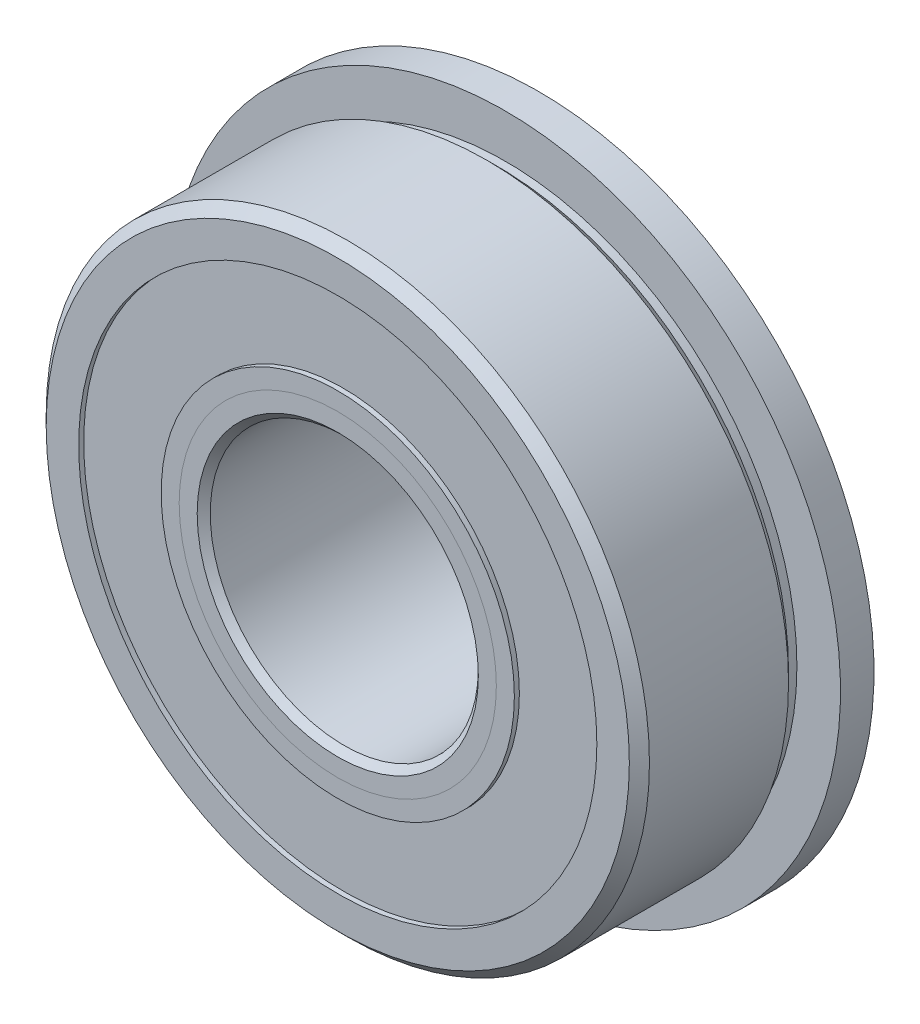
ISO-10303-21;
HEADER;
FILE_DESCRIPTION(('STEP AP214'),'2;1');
FILE_NAME('part.step','',(''),(''),'','','');
FILE_SCHEMA(('AUTOMOTIVE_DESIGN { 1 0 10303 214 1 1 1 1 }'));
ENDSEC;
DATA;
#1=APPLICATION_CONTEXT('core data for automotive mechanical design processes');
#2=APPLICATION_PROTOCOL_DEFINITION('international standard','automotive_design',2000,#1);
#3=PRODUCT_CONTEXT('',#1,'mechanical');
#4=PRODUCT('Part','Part','',(#3));
#5=PRODUCT_RELATED_PRODUCT_CATEGORY('part','',(#4));
#6=PRODUCT_DEFINITION_FORMATION('','',#4);
#7=PRODUCT_DEFINITION_CONTEXT('part definition',#1,'design');
#8=PRODUCT_DEFINITION('design','',#6,#7);
#9=PRODUCT_DEFINITION_SHAPE('','',#8);
#10=(LENGTH_UNIT() NAMED_UNIT(*) SI_UNIT(.MILLI.,.METRE.));
#11=(NAMED_UNIT(*) PLANE_ANGLE_UNIT() SI_UNIT($,.RADIAN.));
#12=(NAMED_UNIT(*) SI_UNIT($,.STERADIAN.) SOLID_ANGLE_UNIT());
#13=UNCERTAINTY_MEASURE_WITH_UNIT(LENGTH_MEASURE(1.E-05),#10,'distance_accuracy_value','');
#14=(GEOMETRIC_REPRESENTATION_CONTEXT(3) GLOBAL_UNCERTAINTY_ASSIGNED_CONTEXT((#13)) GLOBAL_UNIT_ASSIGNED_CONTEXT((#10,
#11,#12)) REPRESENTATION_CONTEXT('',''));
#15=CARTESIAN_POINT('',(0.,0.,0.));
#16=DIRECTION('',(0.,0.,1.));
#17=DIRECTION('',(1.,0.,0.));
#18=AXIS2_PLACEMENT_3D('',#15,#16,#17);
#19=CARTESIAN_POINT('',(0.,0.,4.7625));
#20=DIRECTION('',(0.,0.,1.));
#21=DIRECTION('',(1.,0.,0.));
#22=AXIS2_PLACEMENT_3D('',#19,#20,#21);
#23=CYLINDRICAL_SURFACE('',#22,8.7376);
#24=CARTESIAN_POINT('',(0.,0.,-3.35017734788581));
#25=DIRECTION('',(0.,0.,1.));
#26=DIRECTION('',(1.,0.,0.));
#27=AXIS2_PLACEMENT_3D('',#24,#25,#26);
#28=CIRCLE('',#27,8.7376);
#29=CARTESIAN_POINT('',(8.7376,0.,-3.35017734788581));
#30=VERTEX_POINT('',#29);
#31=EDGE_CURVE('E11',#30,#30,#28,.T.);
#32=ORIENTED_EDGE('',*,*,#31,.T.);
#33=EDGE_LOOP('',(#32));
#34=FACE_BOUND('',#33,.T.);
#35=CARTESIAN_POINT('',(0.,0.,-4.270375));
#36=DIRECTION('',(0.,0.,-1.));
#37=DIRECTION('',(-1.,0.,0.));
#38=AXIS2_PLACEMENT_3D('',#35,#36,#37);
#39=CIRCLE('',#38,8.7376);
#40=CARTESIAN_POINT('',(-8.7376,0.,-4.270375));
#41=VERTEX_POINT('',#40);
#42=EDGE_CURVE('E71',#41,#41,#39,.T.);
#43=ORIENTED_EDGE('',*,*,#42,.T.);
#44=EDGE_LOOP('',(#43));
#45=FACE_BOUND('',#44,.T.);
#46=ADVANCED_FACE('F50',(#34,#45),#23,.F.);
#47=CARTESIAN_POINT('',(0.,12.2725961538462,-4.524375));
#48=DIRECTION('',(0.,0.,1.));
#49=DIRECTION('',(1.,0.,0.));
#50=AXIS2_PLACEMENT_3D('',#47,#48,#49);
#51=PLANE('',#50);
#52=CARTESIAN_POINT('',(0.,0.,-4.524375));
#53=DIRECTION('',(0.,0.,-1.));
#54=DIRECTION('',(-1.,0.,0.));
#55=AXIS2_PLACEMENT_3D('',#52,#53,#54);
#56=CIRCLE('',#55,9.436608);
#57=CARTESIAN_POINT('',(-9.436608,0.,-4.524375));
#58=VERTEX_POINT('',#57);
#59=EDGE_CURVE('E68',#58,#58,#56,.T.);
#60=ORIENTED_EDGE('',*,*,#59,.F.);
#61=EDGE_LOOP('',(#60));
#62=FACE_BOUND('',#61,.T.);
#63=CARTESIAN_POINT('',(0.,0.,-4.524375));
#64=DIRECTION('',(0.,0.,1.));
#65=DIRECTION('',(1.,0.,0.));
#66=AXIS2_PLACEMENT_3D('',#63,#64,#65);
#67=CIRCLE('',#66,12.2725961538462);
#68=CARTESIAN_POINT('',(12.2725961538462,0.,-4.524375));
#69=VERTEX_POINT('',#68);
#70=EDGE_CURVE('E61',#69,#69,#67,.T.);
#71=ORIENTED_EDGE('',*,*,#70,.F.);
#72=EDGE_LOOP('',(#71));
#73=FACE_BOUND('',#72,.T.);
#74=ADVANCED_FACE('F52',(#62,#73),#51,.F.);
#75=CARTESIAN_POINT('',(0.,12.2725961538462,-3.35017734788581));
#76=DIRECTION('',(0.,0.,-1.));
#77=DIRECTION('',(-1.,0.,0.));
#78=AXIS2_PLACEMENT_3D('',#75,#76,#77);
#79=PLANE('',#78);
#80=ORIENTED_EDGE('',*,*,#31,.F.);
#81=EDGE_LOOP('',(#80));
#82=FACE_BOUND('',#81,.T.);
#83=CARTESIAN_POINT('',(0.,0.,-3.35017734788581));
#84=DIRECTION('',(0.,0.,1.));
#85=DIRECTION('',(1.,0.,0.));
#86=AXIS2_PLACEMENT_3D('',#83,#84,#85);
#87=CIRCLE('',#86,12.2725961538462);
#88=CARTESIAN_POINT('',(12.2725961538462,0.,-3.35017734788581));
#89=VERTEX_POINT('',#88);
#90=EDGE_CURVE('E57',#89,#89,#87,.T.);
#91=ORIENTED_EDGE('',*,*,#90,.T.);
#92=EDGE_LOOP('',(#91));
#93=FACE_BOUND('',#92,.T.);
#94=ADVANCED_FACE('F93',(#82,#93),#79,.F.);
#95=CARTESIAN_POINT('',(0.,0.,4.7625));
#96=DIRECTION('',(0.,0.,1.));
#97=DIRECTION('',(1.,0.,0.));
#98=AXIS2_PLACEMENT_3D('',#95,#96,#97);
#99=CYLINDRICAL_SURFACE('',#98,12.2725961538462);
#100=ORIENTED_EDGE('',*,*,#90,.F.);
#101=EDGE_LOOP('',(#100));
#102=FACE_BOUND('',#101,.T.);
#103=ORIENTED_EDGE('',*,*,#70,.T.);
#104=EDGE_LOOP('',(#103));
#105=FACE_BOUND('',#104,.T.);
#106=ADVANCED_FACE('F87',(#102,#105),#99,.T.);
#107=CARTESIAN_POINT('',(0.,0.,-4.270375));
#108=DIRECTION('',(0.,0.,-1.));
#109=DIRECTION('',(-1.,0.,0.));
#110=AXIS2_PLACEMENT_3D('',#107,#108,#109);
#111=CYLINDRICAL_SURFACE('',#110,9.436608);
#112=CARTESIAN_POINT('',(0.,0.,-4.270375));
#113=DIRECTION('',(0.,0.,-1.));
#114=DIRECTION('',(-1.,0.,0.));
#115=AXIS2_PLACEMENT_3D('',#112,#113,#114);
#116=CIRCLE('',#115,9.436608);
#117=CARTESIAN_POINT('',(-9.436608,0.,-4.270375));
#118=VERTEX_POINT('',#117);
#119=EDGE_CURVE('E65',#118,#118,#116,.T.);
#120=ORIENTED_EDGE('',*,*,#119,.F.);
#121=EDGE_LOOP('',(#120));
#122=FACE_BOUND('',#121,.T.);
#123=ORIENTED_EDGE('',*,*,#59,.T.);
#124=EDGE_LOOP('',(#123));
#125=FACE_BOUND('',#124,.T.);
#126=ADVANCED_FACE('F81',(#122,#125),#111,.F.);
#127=CARTESIAN_POINT('',(0.,0.,-4.270375));
#128=DIRECTION('',(0.,0.,-1.));
#129=DIRECTION('',(-1.,0.,0.));
#130=AXIS2_PLACEMENT_3D('',#127,#128,#129);
#131=PLANE('',#130);
#132=ORIENTED_EDGE('',*,*,#42,.F.);
#133=EDGE_LOOP('',(#132));
#134=FACE_BOUND('',#133,.T.);
#135=ORIENTED_EDGE('',*,*,#119,.T.);
#136=EDGE_LOOP('',(#135));
#137=FACE_BOUND('',#136,.T.);
#138=ADVANCED_FACE('F78',(#134,#137),#131,.T.);
#139=CLOSED_SHELL('',(#46,#74,#94,#106,#126,#138));
#140=MANIFOLD_SOLID_BREP('B2',#139);
#141=CARTESIAN_POINT('',(0.,12.2725961538462,4.524375));
#142=DIRECTION('',(0.,0.,-1.));
#143=DIRECTION('',(-1.,0.,0.));
#144=AXIS2_PLACEMENT_3D('',#141,#142,#143);
#145=PLANE('',#144);
#146=CARTESIAN_POINT('',(0.,0.,4.524375));
#147=DIRECTION('',(0.,0.,1.));
#148=DIRECTION('',(1.,0.,0.));
#149=AXIS2_PLACEMENT_3D('',#146,#147,#148);
#150=CIRCLE('',#149,8.36490384615385);
#151=CARTESIAN_POINT('',(8.36490384615385,0.,4.524375));
#152=VERTEX_POINT('',#151);
#153=EDGE_CURVE('E49',#152,#152,#150,.T.);
#154=ORIENTED_EDGE('',*,*,#153,.F.);
#155=EDGE_LOOP('',(#154));
#156=FACE_BOUND('',#155,.T.);
#157=CARTESIAN_POINT('',(0.,0.,4.524375));
#158=DIRECTION('',(0.,0.,1.));
#159=DIRECTION('',(1.,0.,0.));
#160=AXIS2_PLACEMENT_3D('',#157,#158,#159);
#161=CIRCLE('',#160,12.2725961538462);
#162=CARTESIAN_POINT('',(12.2725961538462,0.,4.524375));
#163=VERTEX_POINT('',#162);
#164=EDGE_CURVE('E170',#163,#163,#161,.T.);
#165=ORIENTED_EDGE('',*,*,#164,.T.);
#166=EDGE_LOOP('',(#165));
#167=FACE_BOUND('',#166,.T.);
#168=ADVANCED_FACE('F156',(#156,#167),#145,.F.);
#169=CARTESIAN_POINT('',(0.,0.,4.7625));
#170=DIRECTION('',(0.,0.,1.));
#171=DIRECTION('',(1.,0.,0.));
#172=AXIS2_PLACEMENT_3D('',#169,#170,#171);
#173=CYLINDRICAL_SURFACE('',#172,8.36490384615385);
#174=CARTESIAN_POINT('',(0.,0.,3.3501773478858));
#175=DIRECTION('',(0.,0.,1.));
#176=DIRECTION('',(1.,0.,0.));
#177=AXIS2_PLACEMENT_3D('',#174,#175,#176);
#178=CIRCLE('',#177,8.36490384615385);
#179=CARTESIAN_POINT('',(8.36490384615385,0.,3.3501773478858));
#180=VERTEX_POINT('',#179);
#181=EDGE_CURVE('E162',#180,#180,#178,.T.);
#182=ORIENTED_EDGE('',*,*,#181,.F.);
#183=EDGE_LOOP('',(#182));
#184=FACE_BOUND('',#183,.T.);
#185=ORIENTED_EDGE('',*,*,#153,.T.);
#186=EDGE_LOOP('',(#185));
#187=FACE_BOUND('',#186,.T.);
#188=ADVANCED_FACE('F185',(#184,#187),#173,.F.);
#189=CARTESIAN_POINT('',(0.,12.2725961538462,3.3501773478858));
#190=DIRECTION('',(0.,0.,1.));
#191=DIRECTION('',(1.,0.,0.));
#192=AXIS2_PLACEMENT_3D('',#189,#190,#191);
#193=PLANE('',#192);
#194=CARTESIAN_POINT('',(0.,0.,3.35017734788581));
#195=DIRECTION('',(0.,0.,1.));
#196=DIRECTION('',(1.,0.,0.));
#197=AXIS2_PLACEMENT_3D('',#194,#195,#196);
#198=CIRCLE('',#197,12.2725961538462);
#199=CARTESIAN_POINT('',(12.2725961538462,0.,3.35017734788581));
#200=VERTEX_POINT('',#199);
#201=EDGE_CURVE('E166',#200,#200,#198,.T.);
#202=ORIENTED_EDGE('',*,*,#201,.F.);
#203=EDGE_LOOP('',(#202));
#204=FACE_BOUND('',#203,.T.);
#205=ORIENTED_EDGE('',*,*,#181,.T.);
#206=EDGE_LOOP('',(#205));
#207=FACE_BOUND('',#206,.T.);
#208=ADVANCED_FACE('F180',(#204,#207),#193,.F.);
#209=CARTESIAN_POINT('',(0.,0.,4.7625));
#210=DIRECTION('',(0.,0.,1.));
#211=DIRECTION('',(1.,0.,0.));
#212=AXIS2_PLACEMENT_3D('',#209,#210,#211);
#213=CYLINDRICAL_SURFACE('',#212,12.2725961538462);
#214=ORIENTED_EDGE('',*,*,#164,.F.);
#215=EDGE_LOOP('',(#214));
#216=FACE_BOUND('',#215,.T.);
#217=ORIENTED_EDGE('',*,*,#201,.T.);
#218=EDGE_LOOP('',(#217));
#219=FACE_BOUND('',#218,.T.);
#220=ADVANCED_FACE('F177',(#216,#219),#213,.T.);
#221=CLOSED_SHELL('',(#168,#188,#208,#220));
#222=MANIFOLD_SOLID_BREP('B6',#221);
#223=CARTESIAN_POINT('',(-5.15937499999989,8.93629963530074,0.));
#224=DIRECTION('',(0.,0.,1.));
#225=DIRECTION('',(-0.499999999999989,0.866025403784445,0.));
#226=AXIS2_PLACEMENT_3D('',#223,#224,#225);
#227=SPHERICAL_SURFACE('',#226,3.3501773478858);
#228=CARTESIAN_POINT('',(-5.15937499999989,8.93629963530074,3.3501773478858));
#229=VERTEX_POINT('',#228);
#230=VERTEX_LOOP('',#229);
#231=FACE_BOUND('',#230,.T.);
#232=ADVANCED_FACE('F216',(#231),#227,.T.);
#233=CLOSED_SHELL('',(#232));
#234=MANIFOLD_SOLID_BREP('B44',#233);
#235=CARTESIAN_POINT('',(-8.93629963530062,5.1593750000001,0.));
#236=DIRECTION('',(0.,0.,1.));
#237=DIRECTION('',(-0.866025403784433,0.50000000000001,0.));
#238=AXIS2_PLACEMENT_3D('',#235,#236,#237);
#239=SPHERICAL_SURFACE('',#238,3.3501773478858);
#240=CARTESIAN_POINT('',(-8.93629963530062,5.1593750000001,3.3501773478858));
#241=VERTEX_POINT('',#240);
#242=VERTEX_LOOP('',#241);
#243=FACE_BOUND('',#242,.T.);
#244=ADVANCED_FACE('F235',(#243),#239,.T.);
#245=CLOSED_SHELL('',(#244));
#246=MANIFOLD_SOLID_BREP('B152',#245);
#247=CARTESIAN_POINT('',(-10.31875,1.08083169195563E-13,0.));
#248=DIRECTION('',(0.,0.,1.));
#249=DIRECTION('',(-1.,0.,0.));
#250=AXIS2_PLACEMENT_3D('',#247,#248,#249);
#251=SPHERICAL_SURFACE('',#250,3.3501773478858);
#252=CARTESIAN_POINT('',(-10.31875,1.08083169195563E-13,3.3501773478858));
#253=VERTEX_POINT('',#252);
#254=VERTEX_LOOP('',#253);
#255=FACE_BOUND('',#254,.T.);
#256=ADVANCED_FACE('F254',(#255),#251,.T.);
#257=CLOSED_SHELL('',(#256));
#258=MANIFOLD_SOLID_BREP('B212',#257);
#259=CARTESIAN_POINT('',(-8.93629963530072,-5.15937499999992,0.));
#260=DIRECTION('',(0.,0.,1.));
#261=DIRECTION('',(-0.866025403784443,-0.499999999999992,0.));
#262=AXIS2_PLACEMENT_3D('',#259,#260,#261);
#263=SPHERICAL_SURFACE('',#262,3.3501773478858);
#264=CARTESIAN_POINT('',(-8.93629963530072,-5.15937499999992,3.3501773478858));
#265=VERTEX_POINT('',#264);
#266=VERTEX_LOOP('',#265);
#267=FACE_BOUND('',#266,.T.);
#268=ADVANCED_FACE('F273',(#267),#263,.T.);
#269=CLOSED_SHELL('',(#268));
#270=MANIFOLD_SOLID_BREP('B231',#269);
#271=CARTESIAN_POINT('',(-5.15937500000007,-8.93629963530064,0.));
#272=DIRECTION('',(0.,0.,1.));
#273=DIRECTION('',(-0.500000000000007,-0.866025403784435,0.));
#274=AXIS2_PLACEMENT_3D('',#271,#272,#273);
#275=SPHERICAL_SURFACE('',#274,3.3501773478858);
#276=CARTESIAN_POINT('',(-5.15937500000007,-8.93629963530064,3.3501773478858));
#277=VERTEX_POINT('',#276);
#278=VERTEX_LOOP('',#277);
#279=FACE_BOUND('',#278,.T.);
#280=ADVANCED_FACE('F292',(#279),#275,.T.);
#281=CLOSED_SHELL('',(#280));
#282=MANIFOLD_SOLID_BREP('B250',#281);
#283=CARTESIAN_POINT('',(0.,-10.31875,0.));
#284=DIRECTION('',(0.,0.,1.));
#285=DIRECTION('',(0.,-1.,0.));
#286=AXIS2_PLACEMENT_3D('',#283,#284,#285);
#287=SPHERICAL_SURFACE('',#286,3.3501773478858);
#288=CARTESIAN_POINT('',(0.,-10.31875,3.3501773478858));
#289=VERTEX_POINT('',#288);
#290=VERTEX_LOOP('',#289);
#291=FACE_BOUND('',#290,.T.);
#292=ADVANCED_FACE('F311',(#291),#287,.T.);
#293=CLOSED_SHELL('',(#292));
#294=MANIFOLD_SOLID_BREP('B269',#293);
#295=CARTESIAN_POINT('',(5.15937499999995,-8.93629963530071,0.));
#296=DIRECTION('',(0.,0.,1.));
#297=DIRECTION('',(0.499999999999995,-0.866025403784442,0.));
#298=AXIS2_PLACEMENT_3D('',#295,#296,#297);
#299=SPHERICAL_SURFACE('',#298,3.3501773478858);
#300=CARTESIAN_POINT('',(5.15937499999995,-8.93629963530071,3.3501773478858));
#301=VERTEX_POINT('',#300);
#302=VERTEX_LOOP('',#301);
#303=FACE_BOUND('',#302,.T.);
#304=ADVANCED_FACE('F330',(#303),#299,.T.);
#305=CLOSED_SHELL('',(#304));
#306=MANIFOLD_SOLID_BREP('B288',#305);
#307=CARTESIAN_POINT('',(8.93629963530065,-5.15937500000004,0.));
#308=DIRECTION('',(0.,0.,1.));
#309=DIRECTION('',(0.866025403784436,-0.500000000000004,0.));
#310=AXIS2_PLACEMENT_3D('',#307,#308,#309);
#311=SPHERICAL_SURFACE('',#310,3.3501773478858);
#312=CARTESIAN_POINT('',(8.93629963530065,-5.15937500000004,3.3501773478858));
#313=VERTEX_POINT('',#312);
#314=VERTEX_LOOP('',#313);
#315=FACE_BOUND('',#314,.T.);
#316=ADVANCED_FACE('F349',(#315),#311,.T.);
#317=CLOSED_SHELL('',(#316));
#318=MANIFOLD_SOLID_BREP('B307',#317);
#319=CARTESIAN_POINT('',(10.31875,0.,0.));
#320=DIRECTION('',(0.,0.,1.));
#321=DIRECTION('',(1.,0.,0.));
#322=AXIS2_PLACEMENT_3D('',#319,#320,#321);
#323=SPHERICAL_SURFACE('',#322,3.3501773478858);
#324=CARTESIAN_POINT('',(10.31875,0.,3.3501773478858));
#325=VERTEX_POINT('',#324);
#326=VERTEX_LOOP('',#325);
#327=FACE_BOUND('',#326,.T.);
#328=ADVANCED_FACE('F368',(#327),#323,.T.);
#329=CLOSED_SHELL('',(#328));
#330=MANIFOLD_SOLID_BREP('B326',#329);
#331=CARTESIAN_POINT('',(8.93629963530069,5.15937499999998,0.));
#332=DIRECTION('',(0.,0.,1.));
#333=DIRECTION('',(0.86602540378444,0.499999999999998,0.));
#334=AXIS2_PLACEMENT_3D('',#331,#332,#333);
#335=SPHERICAL_SURFACE('',#334,3.3501773478858);
#336=CARTESIAN_POINT('',(8.93629963530069,5.15937499999998,3.3501773478858));
#337=VERTEX_POINT('',#336);
#338=VERTEX_LOOP('',#337);
#339=FACE_BOUND('',#338,.T.);
#340=ADVANCED_FACE('F387',(#339),#335,.T.);
#341=CLOSED_SHELL('',(#340));
#342=MANIFOLD_SOLID_BREP('B345',#341);
#343=CARTESIAN_POINT('',(5.15937500000001,8.93629963530067,0.));
#344=DIRECTION('',(0.,0.,1.));
#345=DIRECTION('',(0.500000000000001,0.866025403784438,0.));
#346=AXIS2_PLACEMENT_3D('',#343,#344,#345);
#347=SPHERICAL_SURFACE('',#346,3.3501773478858);
#348=CARTESIAN_POINT('',(5.15937500000001,8.93629963530067,3.3501773478858));
#349=VERTEX_POINT('',#348);
#350=VERTEX_LOOP('',#349);
#351=FACE_BOUND('',#350,.T.);
#352=ADVANCED_FACE('F406',(#351),#347,.T.);
#353=CLOSED_SHELL('',(#352));
#354=MANIFOLD_SOLID_BREP('B364',#353);
#355=CARTESIAN_POINT('',(0.,10.31875,0.));
#356=DIRECTION('',(0.,0.,1.));
#357=DIRECTION('',(0.,1.,0.));
#358=AXIS2_PLACEMENT_3D('',#355,#356,#357);
#359=SPHERICAL_SURFACE('',#358,3.3501773478858);
#360=CARTESIAN_POINT('',(0.,10.31875,3.3501773478858));
#361=VERTEX_POINT('',#360);
#362=VERTEX_LOOP('',#361);
#363=FACE_BOUND('',#362,.T.);
#364=ADVANCED_FACE('F427',(#363),#359,.T.);
#365=CLOSED_SHELL('',(#364));
#366=MANIFOLD_SOLID_BREP('B383',#365);
#367=CARTESIAN_POINT('',(0.,6.82625,-6.35));
#368=DIRECTION('',(0.,0.,1.));
#369=DIRECTION('',(1.,0.,0.));
#370=AXIS2_PLACEMENT_3D('',#367,#368,#369);
#371=PLANE('',#370);
#372=CARTESIAN_POINT('',(0.,0.,-6.35));
#373=DIRECTION('',(0.,0.,1.));
#374=DIRECTION('',(1.,0.,0.));
#375=AXIS2_PLACEMENT_3D('',#372,#373,#374);
#376=CIRCLE('',#375,6.82625);
#377=CARTESIAN_POINT('',(6.82625,0.,-6.35));
#378=VERTEX_POINT('',#377);
#379=EDGE_CURVE('E472',#378,#378,#376,.T.);
#380=ORIENTED_EDGE('',*,*,#379,.T.);
#381=EDGE_LOOP('',(#380));
#382=FACE_BOUND('',#381,.T.);
#383=CARTESIAN_POINT('',(0.,0.,-6.35));
#384=DIRECTION('',(0.,0.,-1.));
#385=DIRECTION('',(-1.,0.,0.));
#386=AXIS2_PLACEMENT_3D('',#383,#384,#385);
#387=CIRCLE('',#386,7.607173);
#388=CARTESIAN_POINT('',(-7.607173,0.,-6.35));
#389=VERTEX_POINT('',#388);
#390=EDGE_CURVE('E491',#389,#389,#387,.T.);
#391=ORIENTED_EDGE('',*,*,#390,.T.);
#392=EDGE_LOOP('',(#391));
#393=FACE_BOUND('',#392,.T.);
#394=ADVANCED_FACE('F446',(#382,#393),#371,.F.);
#395=CARTESIAN_POINT('',(0.,7.51209508610547,4.7625));
#396=DIRECTION('',(0.,0.,-1.));
#397=DIRECTION('',(-1.,0.,0.));
#398=AXIS2_PLACEMENT_3D('',#395,#396,#397);
#399=PLANE('',#398);
#400=CARTESIAN_POINT('',(0.,0.,4.7625));
#401=DIRECTION('',(0.,0.,1.));
#402=DIRECTION('',(1.,0.,0.));
#403=AXIS2_PLACEMENT_3D('',#400,#401,#402);
#404=CIRCLE('',#403,6.6592863260571);
#405=CARTESIAN_POINT('',(6.6592863260571,0.,4.7625));
#406=VERTEX_POINT('',#405);
#407=EDGE_CURVE('E481',#406,#406,#404,.T.);
#408=ORIENTED_EDGE('',*,*,#407,.F.);
#409=EDGE_LOOP('',(#408));
#410=FACE_BOUND('',#409,.T.);
#411=CARTESIAN_POINT('',(0.,0.,4.7625));
#412=DIRECTION('',(0.,0.,1.));
#413=DIRECTION('',(1.,0.,0.));
#414=AXIS2_PLACEMENT_3D('',#411,#412,#413);
#415=CIRCLE('',#414,7.51209508610547);
#416=CARTESIAN_POINT('',(7.51209508610547,0.,4.7625));
#417=VERTEX_POINT('',#416);
#418=EDGE_CURVE('E426',#417,#417,#415,.T.);
#419=ORIENTED_EDGE('',*,*,#418,.T.);
#420=EDGE_LOOP('',(#419));
#421=FACE_BOUND('',#420,.T.);
#422=ADVANCED_FACE('F448',(#410,#421),#399,.F.);
#423=CARTESIAN_POINT('',(0.,0.,3.90969123995163));
#424=DIRECTION('',(0.,0.,1.));
#425=DIRECTION('',(1.,0.,0.));
#426=AXIS2_PLACEMENT_3D('',#423,#424,#425);
#427=CONICAL_SURFACE('',#426,6.6592863260571,0.785398163397449);
#428=ORIENTED_EDGE('',*,*,#418,.F.);
#429=EDGE_LOOP('',(#428));
#430=FACE_BOUND('',#429,.T.);
#431=CARTESIAN_POINT('',(0.,0.,3.90969123995163));
#432=DIRECTION('',(0.,0.,1.));
#433=DIRECTION('',(1.,0.,0.));
#434=AXIS2_PLACEMENT_3D('',#431,#432,#433);
#435=CIRCLE('',#434,6.6592863260571);
#436=CARTESIAN_POINT('',(6.6592863260571,0.,3.90969123995163));
#437=VERTEX_POINT('',#436);
#438=EDGE_CURVE('E453',#437,#437,#435,.T.);
#439=ORIENTED_EDGE('',*,*,#438,.T.);
#440=EDGE_LOOP('',(#439));
#441=FACE_BOUND('',#440,.T.);
#442=ADVANCED_FACE('F539',(#430,#441),#427,.T.);
#443=CARTESIAN_POINT('',(0.,0.,4.7625));
#444=DIRECTION('',(0.,0.,1.));
#445=DIRECTION('',(1.,0.,0.));
#446=AXIS2_PLACEMENT_3D('',#443,#444,#445);
#447=CYLINDRICAL_SURFACE('',#446,6.6592863260571);
#448=ORIENTED_EDGE('',*,*,#438,.F.);
#449=EDGE_LOOP('',(#448));
#450=FACE_BOUND('',#449,.T.);
#451=CARTESIAN_POINT('',(0.,0.,0.));
#452=DIRECTION('',(0.,0.,1.));
#453=DIRECTION('',(1.,0.,0.));
#454=AXIS2_PLACEMENT_3D('',#451,#452,#453);
#455=CIRCLE('',#454,6.6592863260571);
#456=CARTESIAN_POINT('',(6.6592863260571,0.,0.));
#457=VERTEX_POINT('',#456);
#458=EDGE_CURVE('E457',#457,#457,#455,.T.);
#459=ORIENTED_EDGE('',*,*,#458,.T.);
#460=EDGE_LOOP('',(#459));
#461=FACE_BOUND('',#460,.T.);
#462=ADVANCED_FACE('F593',(#450,#461),#447,.T.);
#463=CARTESIAN_POINT('',(0.,6.6592863260571,0.));
#464=DIRECTION('',(0.,0.,-1.));
#465=DIRECTION('',(-1.,0.,0.));
#466=AXIS2_PLACEMENT_3D('',#463,#464,#465);
#467=PLANE('',#466);
#468=ORIENTED_EDGE('',*,*,#458,.F.);
#469=EDGE_LOOP('',(#468));
#470=FACE_BOUND('',#469,.T.);
#471=CARTESIAN_POINT('',(0.,0.,0.));
#472=DIRECTION('',(0.,0.,1.));
#473=DIRECTION('',(1.,0.,0.));
#474=AXIS2_PLACEMENT_3D('',#471,#472,#473);
#475=CIRCLE('',#474,6.9685726521142);
#476=CARTESIAN_POINT('',(6.9685726521142,0.,0.));
#477=VERTEX_POINT('',#476);
#478=EDGE_CURVE('E461',#477,#477,#475,.T.);
#479=ORIENTED_EDGE('',*,*,#478,.T.);
#480=EDGE_LOOP('',(#479));
#481=FACE_BOUND('',#480,.T.);
#482=ADVANCED_FACE('F529',(#470,#481),#467,.F.);
#483=CARTESIAN_POINT('',(0.,0.,0.));
#484=DIRECTION('',(0.,0.,1.));
#485=DIRECTION('',(1.,0.,0.));
#486=AXIS2_PLACEMENT_3D('',#483,#484,#485);
#487=TOROIDAL_SURFACE('',#486,10.31875,3.3501773478858);
#488=ORIENTED_EDGE('',*,*,#478,.F.);
#489=EDGE_LOOP('',(#488));
#490=FACE_BOUND('',#489,.T.);
#491=CARTESIAN_POINT('',(0.,0.,-2.9535830680357));
#492=DIRECTION('',(0.,0.,1.));
#493=DIRECTION('',(1.,0.,0.));
#494=AXIS2_PLACEMENT_3D('',#491,#492,#493);
#495=CIRCLE('',#494,8.7376);
#496=CARTESIAN_POINT('',(8.7376,0.,-2.9535830680357));
#497=VERTEX_POINT('',#496);
#498=EDGE_CURVE('E466',#497,#497,#495,.T.);
#499=ORIENTED_EDGE('',*,*,#498,.T.);
#500=EDGE_LOOP('',(#499));
#501=FACE_BOUND('',#500,.T.);
#502=ADVANCED_FACE('F522',(#490,#501),#487,.F.);
#503=CARTESIAN_POINT('',(0.,0.,4.7625));
#504=DIRECTION('',(0.,0.,1.));
#505=DIRECTION('',(1.,0.,0.));
#506=AXIS2_PLACEMENT_3D('',#503,#504,#505);
#507=CYLINDRICAL_SURFACE('',#506,8.7376);
#508=ORIENTED_EDGE('',*,*,#498,.F.);
#509=EDGE_LOOP('',(#508));
#510=FACE_BOUND('',#509,.T.);
#511=CARTESIAN_POINT('',(0.,0.,-6.35));
#512=DIRECTION('',(0.,0.,1.));
#513=DIRECTION('',(1.,0.,0.));
#514=AXIS2_PLACEMENT_3D('',#511,#512,#513);
#515=CIRCLE('',#514,8.7376);
#516=CARTESIAN_POINT('',(8.7376,0.,-6.35));
#517=VERTEX_POINT('',#516);
#518=EDGE_CURVE('E469',#517,#517,#515,.T.);
#519=ORIENTED_EDGE('',*,*,#518,.T.);
#520=EDGE_LOOP('',(#519));
#521=FACE_BOUND('',#520,.T.);
#522=ADVANCED_FACE('F517',(#510,#521),#507,.T.);
#523=CARTESIAN_POINT('',(0.,0.,-6.35));
#524=DIRECTION('',(0.,0.,-1.));
#525=DIRECTION('',(-1.,0.,0.));
#526=AXIS2_PLACEMENT_3D('',#523,#524,#525);
#527=CIRCLE('',#526,7.956677);
#528=CARTESIAN_POINT('',(-7.956677,0.,-6.35));
#529=VERTEX_POINT('',#528);
#530=EDGE_CURVE('E485',#529,#529,#527,.T.);
#531=ORIENTED_EDGE('',*,*,#530,.F.);
#532=EDGE_LOOP('',(#531));
#533=FACE_BOUND('',#532,.T.);
#534=ORIENTED_EDGE('',*,*,#518,.F.);
#535=EDGE_LOOP('',(#534));
#536=FACE_BOUND('',#535,.T.);
#537=ADVANCED_FACE('F513',(#533,#536),#371,.F.);
#538=CARTESIAN_POINT('',(0.,0.,-5.87375));
#539=DIRECTION('',(0.,0.,-1.));
#540=DIRECTION('',(-1.,0.,0.));
#541=AXIS2_PLACEMENT_3D('',#538,#539,#540);
#542=CONICAL_SURFACE('',#541,6.35,0.785398163397445);
#543=ORIENTED_EDGE('',*,*,#379,.F.);
#544=EDGE_LOOP('',(#543));
#545=FACE_BOUND('',#544,.T.);
#546=CARTESIAN_POINT('',(0.,0.,-5.87375));
#547=DIRECTION('',(0.,0.,1.));
#548=DIRECTION('',(1.,0.,0.));
#549=AXIS2_PLACEMENT_3D('',#546,#547,#548);
#550=CIRCLE('',#549,6.35);
#551=CARTESIAN_POINT('',(6.35,0.,-5.87375));
#552=VERTEX_POINT('',#551);
#553=EDGE_CURVE('E475',#552,#552,#550,.T.);
#554=ORIENTED_EDGE('',*,*,#553,.T.);
#555=EDGE_LOOP('',(#554));
#556=FACE_BOUND('',#555,.T.);
#557=ADVANCED_FACE('F516',(#545,#556),#542,.F.);
#558=CARTESIAN_POINT('',(0.,0.,4.7625));
#559=DIRECTION('',(0.,0.,1.));
#560=DIRECTION('',(1.,0.,0.));
#561=AXIS2_PLACEMENT_3D('',#558,#559,#560);
#562=CYLINDRICAL_SURFACE('',#561,6.35);
#563=ORIENTED_EDGE('',*,*,#553,.F.);
#564=EDGE_LOOP('',(#563));
#565=FACE_BOUND('',#564,.T.);
#566=CARTESIAN_POINT('',(0.,0.,4.4532136739429));
#567=DIRECTION('',(0.,0.,1.));
#568=DIRECTION('',(1.,0.,0.));
#569=AXIS2_PLACEMENT_3D('',#566,#567,#568);
#570=CIRCLE('',#569,6.35);
#571=CARTESIAN_POINT('',(6.35,0.,4.4532136739429));
#572=VERTEX_POINT('',#571);
#573=EDGE_CURVE('E478',#572,#572,#570,.T.);
#574=ORIENTED_EDGE('',*,*,#573,.T.);
#575=EDGE_LOOP('',(#574));
#576=FACE_BOUND('',#575,.T.);
#577=ADVANCED_FACE('F544',(#565,#576),#562,.F.);
#578=CARTESIAN_POINT('',(0.,0.,4.7625));
#579=DIRECTION('',(0.,0.,1.));
#580=DIRECTION('',(1.,0.,0.));
#581=AXIS2_PLACEMENT_3D('',#578,#579,#580);
#582=CONICAL_SURFACE('',#581,6.6592863260571,0.78539816339745);
#583=ORIENTED_EDGE('',*,*,#573,.F.);
#584=EDGE_LOOP('',(#583));
#585=FACE_BOUND('',#584,.T.);
#586=ORIENTED_EDGE('',*,*,#407,.T.);
#587=EDGE_LOOP('',(#586));
#588=FACE_BOUND('',#587,.T.);
#589=ADVANCED_FACE('F509',(#585,#588),#582,.F.);
#590=CARTESIAN_POINT('',(0.,0.,-6.223));
#591=DIRECTION('',(0.,0.,-1.));
#592=DIRECTION('',(-1.,0.,0.));
#593=AXIS2_PLACEMENT_3D('',#590,#591,#592);
#594=CYLINDRICAL_SURFACE('',#593,7.956677);
#595=CARTESIAN_POINT('',(0.,0.,-6.223));
#596=DIRECTION('',(0.,0.,-1.));
#597=DIRECTION('',(-1.,0.,0.));
#598=AXIS2_PLACEMENT_3D('',#595,#596,#597);
#599=CIRCLE('',#598,7.956677);
#600=CARTESIAN_POINT('',(-7.956677,0.,-6.223));
#601=VERTEX_POINT('',#600);
#602=EDGE_CURVE('E484',#601,#601,#599,.T.);
#603=ORIENTED_EDGE('',*,*,#602,.F.);
#604=EDGE_LOOP('',(#603));
#605=FACE_BOUND('',#604,.T.);
#606=ORIENTED_EDGE('',*,*,#530,.T.);
#607=EDGE_LOOP('',(#606));
#608=FACE_BOUND('',#607,.T.);
#609=ADVANCED_FACE('F503',(#605,#608),#594,.F.);
#610=CARTESIAN_POINT('',(0.,0.,-6.223));
#611=DIRECTION('',(0.,0.,-1.));
#612=DIRECTION('',(-1.,0.,0.));
#613=AXIS2_PLACEMENT_3D('',#610,#611,#612);
#614=PLANE('',#613);
#615=CARTESIAN_POINT('',(0.,0.,-6.223));
#616=DIRECTION('',(0.,0.,-1.));
#617=DIRECTION('',(-1.,0.,0.));
#618=AXIS2_PLACEMENT_3D('',#615,#616,#617);
#619=CIRCLE('',#618,7.607173);
#620=CARTESIAN_POINT('',(-7.607173,0.,-6.223));
#621=VERTEX_POINT('',#620);
#622=EDGE_CURVE('E488',#621,#621,#619,.T.);
#623=ORIENTED_EDGE('',*,*,#622,.F.);
#624=EDGE_LOOP('',(#623));
#625=FACE_BOUND('',#624,.T.);
#626=ORIENTED_EDGE('',*,*,#602,.T.);
#627=EDGE_LOOP('',(#626));
#628=FACE_BOUND('',#627,.T.);
#629=ADVANCED_FACE('F500',(#625,#628),#614,.T.);
#630=CARTESIAN_POINT('',(0.,0.,-6.223));
#631=DIRECTION('',(0.,0.,-1.));
#632=DIRECTION('',(-1.,0.,0.));
#633=AXIS2_PLACEMENT_3D('',#630,#631,#632);
#634=CYLINDRICAL_SURFACE('',#633,7.607173);
#635=ORIENTED_EDGE('',*,*,#622,.T.);
#636=EDGE_LOOP('',(#635));
#637=FACE_BOUND('',#636,.T.);
#638=ORIENTED_EDGE('',*,*,#390,.F.);
#639=EDGE_LOOP('',(#638));
#640=FACE_BOUND('',#639,.T.);
#641=ADVANCED_FACE('F497',(#637,#640),#634,.T.);
#642=CLOSED_SHELL('',(#394,#422,#442,#462,#482,#502,#522,#537,#557,#577,#589,#609,#629,#641));
#643=MANIFOLD_SOLID_BREP('B402',#642);
#644=CARTESIAN_POINT('',(0.,8.36490384615385,4.7625));
#645=DIRECTION('',(0.,0.,-1.));
#646=DIRECTION('',(-1.,0.,0.));
#647=AXIS2_PLACEMENT_3D('',#644,#645,#646);
#648=PLANE('',#647);
#649=CARTESIAN_POINT('',(0.,0.,4.7625));
#650=DIRECTION('',(0.,0.,1.));
#651=DIRECTION('',(1.,0.,0.));
#652=AXIS2_PLACEMENT_3D('',#649,#650,#651);
#653=CIRCLE('',#652,7.51209508610547);
#654=CARTESIAN_POINT('',(7.51209508610547,0.,4.7625));
#655=VERTEX_POINT('',#654);
#656=EDGE_CURVE('E445',#655,#655,#653,.T.);
#657=ORIENTED_EDGE('',*,*,#656,.F.);
#658=EDGE_LOOP('',(#657));
#659=FACE_BOUND('',#658,.T.);
#660=CARTESIAN_POINT('',(0.,0.,4.7625));
#661=DIRECTION('',(0.,0.,1.));
#662=DIRECTION('',(1.,0.,0.));
#663=AXIS2_PLACEMENT_3D('',#660,#661,#662);
#664=CIRCLE('',#663,8.36490384615385);
#665=CARTESIAN_POINT('',(8.36490384615385,0.,4.7625));
#666=VERTEX_POINT('',#665);
#667=EDGE_CURVE('E658',#666,#666,#664,.T.);
#668=ORIENTED_EDGE('',*,*,#667,.T.);
#669=EDGE_LOOP('',(#668));
#670=FACE_BOUND('',#669,.T.);
#671=ADVANCED_FACE('F636',(#659,#670),#648,.F.);
#672=CARTESIAN_POINT('',(0.,0.,4.7625));
#673=DIRECTION('',(0.,0.,1.));
#674=DIRECTION('',(1.,0.,0.));
#675=AXIS2_PLACEMENT_3D('',#672,#673,#674);
#676=CONICAL_SURFACE('',#675,7.51209508610547,0.785398163397449);
#677=CARTESIAN_POINT('',(0.,0.,3.90969123995163));
#678=DIRECTION('',(0.,0.,1.));
#679=DIRECTION('',(1.,0.,0.));
#680=AXIS2_PLACEMENT_3D('',#677,#678,#679);
#681=CIRCLE('',#680,6.6592863260571);
#682=CARTESIAN_POINT('',(6.6592863260571,0.,3.90969123995163));
#683=VERTEX_POINT('',#682);
#684=EDGE_CURVE('E642',#683,#683,#681,.T.);
#685=ORIENTED_EDGE('',*,*,#684,.F.);
#686=EDGE_LOOP('',(#685));
#687=FACE_BOUND('',#686,.T.);
#688=ORIENTED_EDGE('',*,*,#656,.T.);
#689=EDGE_LOOP('',(#688));
#690=FACE_BOUND('',#689,.T.);
#691=ADVANCED_FACE('F683',(#687,#690),#676,.F.);
#692=CARTESIAN_POINT('',(0.,0.,4.7625));
#693=DIRECTION('',(0.,0.,1.));
#694=DIRECTION('',(1.,0.,0.));
#695=AXIS2_PLACEMENT_3D('',#692,#693,#694);
#696=CYLINDRICAL_SURFACE('',#695,6.6592863260571);
#697=CARTESIAN_POINT('',(0.,0.,0.));
#698=DIRECTION('',(0.,0.,1.));
#699=DIRECTION('',(1.,0.,0.));
#700=AXIS2_PLACEMENT_3D('',#697,#698,#699);
#701=CIRCLE('',#700,6.6592863260571);
#702=CARTESIAN_POINT('',(6.6592863260571,0.,0.));
#703=VERTEX_POINT('',#702);
#704=EDGE_CURVE('E646',#703,#703,#701,.T.);
#705=ORIENTED_EDGE('',*,*,#704,.F.);
#706=EDGE_LOOP('',(#705));
#707=FACE_BOUND('',#706,.T.);
#708=ORIENTED_EDGE('',*,*,#684,.T.);
#709=EDGE_LOOP('',(#708));
#710=FACE_BOUND('',#709,.T.);
#711=ADVANCED_FACE('F678',(#707,#710),#696,.F.);
#712=CARTESIAN_POINT('',(0.,6.6592863260571,0.));
#713=DIRECTION('',(0.,0.,1.));
#714=DIRECTION('',(1.,0.,0.));
#715=AXIS2_PLACEMENT_3D('',#712,#713,#714);
#716=PLANE('',#715);
#717=CARTESIAN_POINT('',(0.,0.,0.));
#718=DIRECTION('',(0.,0.,1.));
#719=DIRECTION('',(1.,0.,0.));
#720=AXIS2_PLACEMENT_3D('',#717,#718,#719);
#721=CIRCLE('',#720,6.9685726521142);
#722=CARTESIAN_POINT('',(6.9685726521142,0.,0.));
#723=VERTEX_POINT('',#722);
#724=EDGE_CURVE('E650',#723,#723,#721,.T.);
#725=ORIENTED_EDGE('',*,*,#724,.F.);
#726=EDGE_LOOP('',(#725));
#727=FACE_BOUND('',#726,.T.);
#728=ORIENTED_EDGE('',*,*,#704,.T.);
#729=EDGE_LOOP('',(#728));
#730=FACE_BOUND('',#729,.T.);
#731=ADVANCED_FACE('F672',(#727,#730),#716,.F.);
#732=CARTESIAN_POINT('',(0.,0.,0.));
#733=DIRECTION('',(0.,0.,1.));
#734=DIRECTION('',(1.,0.,0.));
#735=AXIS2_PLACEMENT_3D('',#732,#733,#734);
#736=TOROIDAL_SURFACE('',#735,10.31875,3.3501773478858);
#737=CARTESIAN_POINT('',(0.,0.,2.72142857142857));
#738=DIRECTION('',(0.,0.,1.));
#739=DIRECTION('',(1.,0.,0.));
#740=AXIS2_PLACEMENT_3D('',#737,#738,#739);
#741=CIRCLE('',#740,8.36490384615385);
#742=CARTESIAN_POINT('',(8.36490384615385,0.,2.72142857142857));
#743=VERTEX_POINT('',#742);
#744=EDGE_CURVE('E655',#743,#743,#741,.T.);
#745=ORIENTED_EDGE('',*,*,#744,.F.);
#746=EDGE_LOOP('',(#745));
#747=FACE_BOUND('',#746,.T.);
#748=ORIENTED_EDGE('',*,*,#724,.T.);
#749=EDGE_LOOP('',(#748));
#750=FACE_BOUND('',#749,.T.);
#751=ADVANCED_FACE('F666',(#747,#750),#736,.F.);
#752=CARTESIAN_POINT('',(0.,0.,4.7625));
#753=DIRECTION('',(0.,0.,1.));
#754=DIRECTION('',(1.,0.,0.));
#755=AXIS2_PLACEMENT_3D('',#752,#753,#754);
#756=CYLINDRICAL_SURFACE('',#755,8.36490384615385);
#757=ORIENTED_EDGE('',*,*,#667,.F.);
#758=EDGE_LOOP('',(#757));
#759=FACE_BOUND('',#758,.T.);
#760=ORIENTED_EDGE('',*,*,#744,.T.);
#761=EDGE_LOOP('',(#760));
#762=FACE_BOUND('',#761,.T.);
#763=ADVANCED_FACE('F663',(#759,#762),#756,.T.);
#764=CLOSED_SHELL('',(#671,#691,#711,#731,#751,#763));
#765=MANIFOLD_SOLID_BREP('B421',#764);
#766=CARTESIAN_POINT('',(0.,0.,4.7625));
#767=DIRECTION('',(0.,0.,1.));
#768=DIRECTION('',(1.,0.,0.));
#769=AXIS2_PLACEMENT_3D('',#766,#767,#768);
#770=CYLINDRICAL_SURFACE('',#769,14.2875);
#771=CARTESIAN_POINT('',(0.,0.,4.28625));
#772=DIRECTION('',(0.,0.,1.));
#773=DIRECTION('',(1.,0.,0.));
#774=AXIS2_PLACEMENT_3D('',#771,#772,#773);
#775=CIRCLE('',#774,14.2875);
#776=CARTESIAN_POINT('',(14.2875,0.,4.28625));
#777=VERTEX_POINT('',#776);
#778=EDGE_CURVE('E727',#777,#777,#775,.T.);
#779=ORIENTED_EDGE('',*,*,#778,.F.);
#780=EDGE_LOOP('',(#779));
#781=FACE_BOUND('',#780,.T.);
#782=CARTESIAN_POINT('',(0.,0.,-2.301875));
#783=DIRECTION('',(0.,0.,1.));
#784=DIRECTION('',(1.,0.,0.));
#785=AXIS2_PLACEMENT_3D('',#782,#783,#784);
#786=CIRCLE('',#785,14.2875);
#787=CARTESIAN_POINT('',(14.2875,0.,-2.301875));
#788=VERTEX_POINT('',#787);
#789=EDGE_CURVE('E754',#788,#788,#786,.T.);
#790=ORIENTED_EDGE('',*,*,#789,.T.);
#791=EDGE_LOOP('',(#790));
#792=FACE_BOUND('',#791,.T.);
#793=ADVANCED_FACE('F716',(#781,#792),#770,.T.);
#794=CARTESIAN_POINT('',(0.,0.,0.));
#795=DIRECTION('',(0.,0.,1.));
#796=DIRECTION('',(1.,0.,0.));
#797=AXIS2_PLACEMENT_3D('',#794,#795,#796);
#798=TOROIDAL_SURFACE('',#797,10.31875,3.3501773478858);
#799=CARTESIAN_POINT('',(0.,0.,2.72142857142857));
#800=DIRECTION('',(0.,0.,1.));
#801=DIRECTION('',(1.,0.,0.));
#802=AXIS2_PLACEMENT_3D('',#799,#800,#801);
#803=CIRCLE('',#802,12.2725961538462);
#804=CARTESIAN_POINT('',(12.2725961538462,0.,2.72142857142857));
#805=VERTEX_POINT('',#804);
#806=EDGE_CURVE('E739',#805,#805,#803,.T.);
#807=ORIENTED_EDGE('',*,*,#806,.T.);
#808=EDGE_LOOP('',(#807));
#809=FACE_BOUND('',#808,.T.);
#810=CARTESIAN_POINT('',(0.,0.,-2.72142857142857));
#811=DIRECTION('',(0.,0.,1.));
#812=DIRECTION('',(1.,0.,0.));
#813=AXIS2_PLACEMENT_3D('',#810,#811,#812);
#814=CIRCLE('',#813,12.2725961538462);
#815=CARTESIAN_POINT('',(12.2725961538462,0.,-2.72142857142857));
#816=VERTEX_POINT('',#815);
#817=EDGE_CURVE('E635',#816,#816,#814,.T.);
#818=ORIENTED_EDGE('',*,*,#817,.F.);
#819=EDGE_LOOP('',(#818));
#820=FACE_BOUND('',#819,.T.);
#821=ADVANCED_FACE('F718',(#809,#820),#798,.F.);
#822=CARTESIAN_POINT('',(0.,0.,4.7625));
#823=DIRECTION('',(0.,0.,1.));
#824=DIRECTION('',(1.,0.,0.));
#825=AXIS2_PLACEMENT_3D('',#822,#823,#824);
#826=CYLINDRICAL_SURFACE('',#825,12.2725961538462);
#827=ORIENTED_EDGE('',*,*,#817,.T.);
#828=EDGE_LOOP('',(#827));
#829=FACE_BOUND('',#828,.T.);
#830=CARTESIAN_POINT('',(0.,0.,-4.7625));
#831=DIRECTION('',(0.,0.,1.));
#832=DIRECTION('',(1.,0.,0.));
#833=AXIS2_PLACEMENT_3D('',#830,#831,#832);
#834=CIRCLE('',#833,12.2725961538462);
#835=CARTESIAN_POINT('',(12.2725961538462,0.,-4.7625));
#836=VERTEX_POINT('',#835);
#837=EDGE_CURVE('E723',#836,#836,#834,.T.);
#838=ORIENTED_EDGE('',*,*,#837,.F.);
#839=EDGE_LOOP('',(#838));
#840=FACE_BOUND('',#839,.T.);
#841=ADVANCED_FACE('F778',(#829,#840),#826,.F.);
#842=CARTESIAN_POINT('',(0.,0.,-4.7625));
#843=DIRECTION('',(0.,0.,-1.));
#844=DIRECTION('',(-1.,0.,0.));
#845=AXIS2_PLACEMENT_3D('',#842,#843,#844);
#846=PLANE('',#845);
#847=ORIENTED_EDGE('',*,*,#837,.T.);
#848=EDGE_LOOP('',(#847));
#849=FACE_BOUND('',#848,.T.);
#850=CARTESIAN_POINT('',(0.,0.,-4.7625));
#851=DIRECTION('',(0.,0.,-1.));
#852=DIRECTION('',(-1.,0.,0.));
#853=AXIS2_PLACEMENT_3D('',#850,#851,#852);
#854=CIRCLE('',#853,15.875);
#855=CARTESIAN_POINT('',(-15.875,0.,-4.7625));
#856=VERTEX_POINT('',#855);
#857=EDGE_CURVE('E742',#856,#856,#854,.T.);
#858=ORIENTED_EDGE('',*,*,#857,.T.);
#859=EDGE_LOOP('',(#858));
#860=FACE_BOUND('',#859,.T.);
#861=ADVANCED_FACE('F785',(#849,#860),#846,.T.);
#862=CARTESIAN_POINT('',(0.,0.,4.28625));
#863=DIRECTION('',(0.,0.,-1.));
#864=DIRECTION('',(-1.,0.,0.));
#865=AXIS2_PLACEMENT_3D('',#862,#863,#864);
#866=CONICAL_SURFACE('',#865,14.2875,0.785398163397447);
#867=CARTESIAN_POINT('',(0.,0.,4.7625));
#868=DIRECTION('',(0.,0.,1.));
#869=DIRECTION('',(1.,0.,0.));
#870=AXIS2_PLACEMENT_3D('',#867,#868,#869);
#871=CIRCLE('',#870,13.81125);
#872=CARTESIAN_POINT('',(13.81125,0.,4.7625));
#873=VERTEX_POINT('',#872);
#874=EDGE_CURVE('E731',#873,#873,#871,.T.);
#875=ORIENTED_EDGE('',*,*,#874,.F.);
#876=EDGE_LOOP('',(#875));
#877=FACE_BOUND('',#876,.T.);
#878=ORIENTED_EDGE('',*,*,#778,.T.);
#879=EDGE_LOOP('',(#878));
#880=FACE_BOUND('',#879,.T.);
#881=ADVANCED_FACE('F783',(#877,#880),#866,.T.);
#882=CARTESIAN_POINT('',(0.,0.,4.7625));
#883=DIRECTION('',(0.,0.,-1.));
#884=DIRECTION('',(-1.,0.,0.));
#885=AXIS2_PLACEMENT_3D('',#882,#883,#884);
#886=PLANE('',#885);
#887=CARTESIAN_POINT('',(0.,0.,4.7625));
#888=DIRECTION('',(0.,0.,1.));
#889=DIRECTION('',(1.,0.,0.));
#890=AXIS2_PLACEMENT_3D('',#887,#888,#889);
#891=CIRCLE('',#890,12.2725961538462);
#892=CARTESIAN_POINT('',(12.2725961538462,0.,4.7625));
#893=VERTEX_POINT('',#892);
#894=EDGE_CURVE('E736',#893,#893,#891,.T.);
#895=ORIENTED_EDGE('',*,*,#894,.F.);
#896=EDGE_LOOP('',(#895));
#897=FACE_BOUND('',#896,.T.);
#898=ORIENTED_EDGE('',*,*,#874,.T.);
#899=EDGE_LOOP('',(#898));
#900=FACE_BOUND('',#899,.T.);
#901=ADVANCED_FACE('F800',(#897,#900),#886,.F.);
#902=CARTESIAN_POINT('',(0.,0.,4.7625));
#903=DIRECTION('',(0.,0.,1.));
#904=DIRECTION('',(1.,0.,0.));
#905=AXIS2_PLACEMENT_3D('',#902,#903,#904);
#906=CYLINDRICAL_SURFACE('',#905,12.2725961538462);
#907=ORIENTED_EDGE('',*,*,#806,.F.);
#908=EDGE_LOOP('',(#907));
#909=FACE_BOUND('',#908,.T.);
#910=ORIENTED_EDGE('',*,*,#894,.T.);
#911=EDGE_LOOP('',(#910));
#912=FACE_BOUND('',#911,.T.);
#913=ADVANCED_FACE('F807',(#909,#912),#906,.F.);
#914=CARTESIAN_POINT('',(0.,13.0419230769231,-3.175));
#915=DIRECTION('',(0.,0.,1.));
#916=DIRECTION('',(1.,0.,0.));
#917=AXIS2_PLACEMENT_3D('',#914,#915,#916);
#918=PLANE('',#917);
#919=CARTESIAN_POINT('',(0.,0.,-3.175));
#920=DIRECTION('',(0.,0.,-1.));
#921=DIRECTION('',(-1.,0.,0.));
#922=AXIS2_PLACEMENT_3D('',#919,#920,#921);
#923=CIRCLE('',#922,15.875);
#924=CARTESIAN_POINT('',(-15.875,0.,-3.175));
#925=VERTEX_POINT('',#924);
#926=EDGE_CURVE('E745',#925,#925,#923,.T.);
#927=ORIENTED_EDGE('',*,*,#926,.F.);
#928=EDGE_LOOP('',(#927));
#929=FACE_BOUND('',#928,.T.);
#930=CARTESIAN_POINT('',(0.,0.,-3.175));
#931=DIRECTION('',(0.,0.,1.));
#932=DIRECTION('',(1.,0.,0.));
#933=AXIS2_PLACEMENT_3D('',#930,#931,#932);
#934=CIRCLE('',#933,13.81125);
#935=CARTESIAN_POINT('',(13.81125,0.,-3.175));
#936=VERTEX_POINT('',#935);
#937=EDGE_CURVE('E748',#936,#936,#934,.T.);
#938=ORIENTED_EDGE('',*,*,#937,.F.);
#939=EDGE_LOOP('',(#938));
#940=FACE_BOUND('',#939,.T.);
#941=ADVANCED_FACE('F813',(#929,#940),#918,.T.);
#942=CARTESIAN_POINT('',(0.,0.,-6.35));
#943=DIRECTION('',(0.,0.,-1.));
#944=DIRECTION('',(-1.,0.,0.));
#945=AXIS2_PLACEMENT_3D('',#942,#943,#944);
#946=CYLINDRICAL_SURFACE('',#945,15.875);
#947=ORIENTED_EDGE('',*,*,#926,.T.);
#948=EDGE_LOOP('',(#947));
#949=FACE_BOUND('',#948,.T.);
#950=ORIENTED_EDGE('',*,*,#857,.F.);
#951=EDGE_LOOP('',(#950));
#952=FACE_BOUND('',#951,.T.);
#953=ADVANCED_FACE('F767',(#949,#952),#946,.T.);
#954=CARTESIAN_POINT('',(0.,0.,4.7625));
#955=DIRECTION('',(0.,0.,1.));
#956=DIRECTION('',(1.,0.,0.));
#957=AXIS2_PLACEMENT_3D('',#954,#955,#956);
#958=CYLINDRICAL_SURFACE('',#957,13.81125);
#959=ORIENTED_EDGE('',*,*,#937,.T.);
#960=EDGE_LOOP('',(#959));
#961=FACE_BOUND('',#960,.T.);
#962=CARTESIAN_POINT('',(0.,0.,-2.778125));
#963=DIRECTION('',(0.,0.,1.));
#964=DIRECTION('',(1.,0.,0.));
#965=AXIS2_PLACEMENT_3D('',#962,#963,#964);
#966=CIRCLE('',#965,13.81125);
#967=CARTESIAN_POINT('',(13.81125,0.,-2.778125));
#968=VERTEX_POINT('',#967);
#969=EDGE_CURVE('E751',#968,#968,#966,.T.);
#970=ORIENTED_EDGE('',*,*,#969,.F.);
#971=EDGE_LOOP('',(#970));
#972=FACE_BOUND('',#971,.T.);
#973=ADVANCED_FACE('F761',(#961,#972),#958,.T.);
#974=CARTESIAN_POINT('',(0.,0.,-2.301875));
#975=DIRECTION('',(0.,0.,1.));
#976=DIRECTION('',(1.,0.,0.));
#977=AXIS2_PLACEMENT_3D('',#974,#975,#976);
#978=CONICAL_SURFACE('',#977,14.2875,0.785398163397445);
#979=ORIENTED_EDGE('',*,*,#969,.T.);
#980=EDGE_LOOP('',(#979));
#981=FACE_BOUND('',#980,.T.);
#982=ORIENTED_EDGE('',*,*,#789,.F.);
#983=EDGE_LOOP('',(#982));
#984=FACE_BOUND('',#983,.T.);
#985=ADVANCED_FACE('F759',(#981,#984),#978,.T.);
#986=CLOSED_SHELL('',(#793,#821,#841,#861,#881,#901,#913,#941,#953,#973,#985));
#987=MANIFOLD_SOLID_BREP('B440',#986);
#988=ADVANCED_BREP_SHAPE_REPRESENTATION('',(#18,#140,#222,#234,#246,#258,#270,#282,#294,#306,
#318,#330,#342,#354,#366,#643,#765,#987),#14);
#989=SHAPE_DEFINITION_REPRESENTATION(#9,#988);
ENDSEC;
END-ISO-10303-21;
